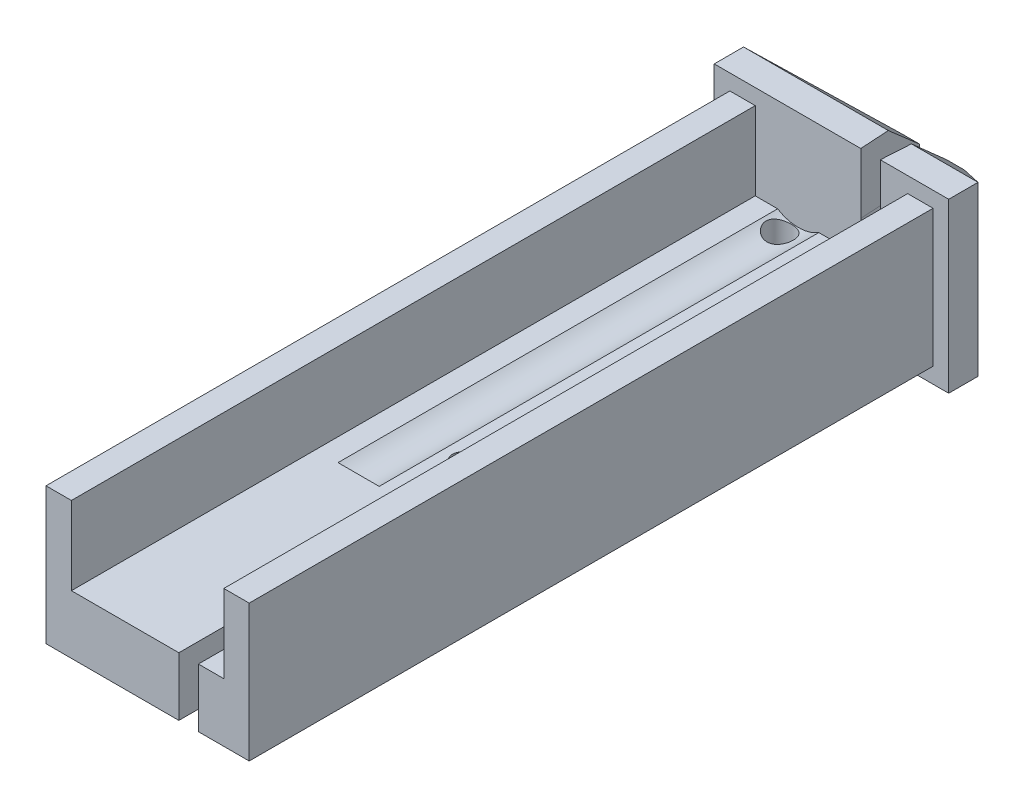
ISO-10303-21;
HEADER;
FILE_DESCRIPTION(('STEP AP214'),'2;1');
FILE_NAME('part.step','',(''),(''),'','','');
FILE_SCHEMA(('AUTOMOTIVE_DESIGN { 1 0 10303 214 1 1 1 1 }'));
ENDSEC;
DATA;
#1=APPLICATION_CONTEXT('core data for automotive mechanical design processes');
#2=APPLICATION_PROTOCOL_DEFINITION('international standard','automotive_design',2000,#1);
#3=PRODUCT_CONTEXT('',#1,'mechanical');
#4=PRODUCT('Part','Part','',(#3));
#5=PRODUCT_RELATED_PRODUCT_CATEGORY('part','',(#4));
#6=PRODUCT_DEFINITION_FORMATION('','',#4);
#7=PRODUCT_DEFINITION_CONTEXT('part definition',#1,'design');
#8=PRODUCT_DEFINITION('design','',#6,#7);
#9=PRODUCT_DEFINITION_SHAPE('','',#8);
#10=(LENGTH_UNIT() NAMED_UNIT(*) SI_UNIT(.MILLI.,.METRE.));
#11=(NAMED_UNIT(*) PLANE_ANGLE_UNIT() SI_UNIT($,.RADIAN.));
#12=(NAMED_UNIT(*) SI_UNIT($,.STERADIAN.) SOLID_ANGLE_UNIT());
#13=UNCERTAINTY_MEASURE_WITH_UNIT(LENGTH_MEASURE(1.E-05),#10,'distance_accuracy_value','');
#14=(GEOMETRIC_REPRESENTATION_CONTEXT(3) GLOBAL_UNCERTAINTY_ASSIGNED_CONTEXT((#13)) GLOBAL_UNIT_ASSIGNED_CONTEXT((#10,
#11,#12)) REPRESENTATION_CONTEXT('',''));
#15=CARTESIAN_POINT('',(0.,0.,0.));
#16=DIRECTION('',(0.,0.,1.));
#17=DIRECTION('',(1.,0.,0.));
#18=AXIS2_PLACEMENT_3D('',#15,#16,#17);
#19=CARTESIAN_POINT('',(-2.05,2.25,19.5904537629872));
#20=DIRECTION('',(0.,1.,0.));
#21=DIRECTION('',(0.,0.,1.));
#22=AXIS2_PLACEMENT_3D('',#19,#20,#21);
#23=PLANE('',#22);
#24=CARTESIAN_POINT('',(-3.85,2.25,11.2));
#25=DIRECTION('',(0.,1.,0.));
#26=DIRECTION('',(0.,0.,1.));
#27=AXIS2_PLACEMENT_3D('',#24,#25,#26);
#28=CIRCLE('',#27,0.250000000000001);
#29=CARTESIAN_POINT('',(-3.85,2.25,11.45));
#30=VERTEX_POINT('',#29);
#31=EDGE_CURVE('E346',#30,#30,#28,.T.);
#32=ORIENTED_EDGE('',*,*,#31,.F.);
#33=EDGE_LOOP('',(#32));
#34=FACE_BOUND('',#33,.T.);
#35=DIRECTION('',(-1.,0.,0.));
#36=VECTOR('',#35,1.);
#37=CARTESIAN_POINT('',(-2.05,2.25,1.6));
#38=LINE('',#37,#36);
#39=CARTESIAN_POINT('',(-2.05,2.25,1.6));
#40=VERTEX_POINT('',#39);
#41=CARTESIAN_POINT('',(-4.32321731235736,2.25,1.6));
#42=VERTEX_POINT('',#41);
#43=EDGE_CURVE('E226',#40,#42,#38,.T.);
#44=ORIENTED_EDGE('',*,*,#43,.T.);
#45=DIRECTION('',(0.,0.,-1.));
#46=VECTOR('',#45,1.);
#47=CARTESIAN_POINT('',(-4.32321731235736,2.25,12.85));
#48=LINE('',#47,#46);
#49=CARTESIAN_POINT('',(-4.32321731235736,2.25,12.85));
#50=VERTEX_POINT('',#49);
#51=EDGE_CURVE('E219',#42,#50,#48,.F.);
#52=ORIENTED_EDGE('',*,*,#51,.T.);
#53=DIRECTION('',(1.,0.,0.));
#54=VECTOR('',#53,1.);
#55=CARTESIAN_POINT('',(-2.05,2.25,12.85));
#56=LINE('',#55,#54);
#57=CARTESIAN_POINT('',(-5.37678268764263,2.25,12.85));
#58=VERTEX_POINT('',#57);
#59=EDGE_CURVE('E11',#58,#50,#56,.T.);
#60=ORIENTED_EDGE('',*,*,#59,.F.);
#61=DIRECTION('',(0.,0.,-1.));
#62=VECTOR('',#61,1.);
#63=CARTESIAN_POINT('',(-5.37678268764263,2.25,12.85));
#64=LINE('',#63,#62);
#65=CARTESIAN_POINT('',(-5.37678268764263,2.25,1.6));
#66=VERTEX_POINT('',#65);
#67=EDGE_CURVE('E211',#58,#66,#64,.T.);
#68=ORIENTED_EDGE('',*,*,#67,.T.);
#69=CARTESIAN_POINT('',(-5.95,2.25,1.6));
#70=VERTEX_POINT('',#69);
#71=EDGE_CURVE('E355',#66,#70,#38,.T.);
#72=ORIENTED_EDGE('',*,*,#71,.T.);
#73=DIRECTION('',(0.,0.,1.));
#74=VECTOR('',#73,1.);
#75=CARTESIAN_POINT('',(-5.95,2.25,19.5904537629872));
#76=LINE('',#75,#74);
#77=CARTESIAN_POINT('',(-5.95,2.25,19.1));
#78=VERTEX_POINT('',#77);
#79=EDGE_CURVE('E357',#70,#78,#76,.T.);
#80=ORIENTED_EDGE('',*,*,#79,.T.);
#81=DIRECTION('',(-1.,0.,0.));
#82=VECTOR('',#81,1.);
#83=CARTESIAN_POINT('',(0.,2.25,19.1));
#84=LINE('',#83,#82);
#85=CARTESIAN_POINT('',(-3.19999965507425,2.25,19.1));
#86=VERTEX_POINT('',#85);
#87=EDGE_CURVE('E408',#86,#78,#84,.T.);
#88=ORIENTED_EDGE('',*,*,#87,.F.);
#89=CARTESIAN_POINT('',(-2.95,2.25,19.0995847136466));
#90=DIRECTION('',(0.,1.,0.));
#91=DIRECTION('',(0.,0.,-1.));
#92=AXIS2_PLACEMENT_3D('',#89,#90,#91);
#93=CIRCLE('',#92,0.25);
#94=CARTESIAN_POINT('',(-3.2,2.25,19.0995847136466));
#95=VERTEX_POINT('',#94);
#96=EDGE_CURVE('E310',#95,#86,#93,.T.);
#97=ORIENTED_EDGE('',*,*,#96,.F.);
#98=DIRECTION('',(0.,0.,1.));
#99=VECTOR('',#98,1.);
#100=CARTESIAN_POINT('',(-3.2,2.25,19.0995847136466));
#101=LINE('',#100,#99);
#102=CARTESIAN_POINT('',(-3.2,2.25,11.0995847136466));
#103=VERTEX_POINT('',#102);
#104=EDGE_CURVE('E318',#103,#95,#101,.T.);
#105=ORIENTED_EDGE('',*,*,#104,.F.);
#106=CARTESIAN_POINT('',(-2.95,2.25,11.0995847136466));
#107=DIRECTION('',(0.,1.,0.));
#108=DIRECTION('',(0.,0.,-1.));
#109=AXIS2_PLACEMENT_3D('',#106,#107,#108);
#110=CIRCLE('',#109,0.25);
#111=CARTESIAN_POINT('',(-2.7,2.25,11.0995847136466));
#112=VERTEX_POINT('',#111);
#113=EDGE_CURVE('E315',#112,#103,#110,.T.);
#114=ORIENTED_EDGE('',*,*,#113,.F.);
#115=DIRECTION('',(0.,0.,-1.));
#116=VECTOR('',#115,1.);
#117=CARTESIAN_POINT('',(-2.7,2.25,19.0995847136466));
#118=LINE('',#117,#116);
#119=CARTESIAN_POINT('',(-2.7,2.25,19.0995847136466));
#120=VERTEX_POINT('',#119);
#121=EDGE_CURVE('E312',#120,#112,#118,.T.);
#122=ORIENTED_EDGE('',*,*,#121,.F.);
#123=CARTESIAN_POINT('',(-2.95,2.25,19.0995847136466));
#124=DIRECTION('',(0.,1.,0.));
#125=DIRECTION('',(0.,0.,1.));
#126=AXIS2_PLACEMENT_3D('',#123,#124,#125);
#127=CIRCLE('',#126,0.25);
#128=CARTESIAN_POINT('',(-2.70000034492575,2.25,19.1));
#129=VERTEX_POINT('',#128);
#130=EDGE_CURVE('E412',#129,#120,#127,.T.);
#131=ORIENTED_EDGE('',*,*,#130,.F.);
#132=CARTESIAN_POINT('',(-2.05,2.25,19.1));
#133=VERTEX_POINT('',#132);
#134=EDGE_CURVE('E409',#133,#129,#84,.T.);
#135=ORIENTED_EDGE('',*,*,#134,.F.);
#136=DIRECTION('',(0.,0.,-1.));
#137=VECTOR('',#136,1.);
#138=CARTESIAN_POINT('',(-2.05,2.25,19.5904537629872));
#139=LINE('',#138,#137);
#140=EDGE_CURVE('E353',#133,#40,#139,.T.);
#141=ORIENTED_EDGE('',*,*,#140,.T.);
#142=EDGE_LOOP('',(#44,#52,#60,#68,#72,#80,#88,#97,#105,#114,#122,#131,#135,#141));
#143=FACE_BOUND('',#142,.T.);
#144=ADVANCED_FACE('F30',(#34,#143),#23,.T.);
#145=CARTESIAN_POINT('',(-4.95,0.25,1.975));
#146=DIRECTION('',(0.,1.,0.));
#147=DIRECTION('',(0.,0.,1.));
#148=AXIS2_PLACEMENT_3D('',#145,#146,#147);
#149=CYLINDRICAL_SURFACE('',#148,0.350000000000001);
#150=CARTESIAN_POINT('',(-4.95,0.75,1.975));
#151=DIRECTION('',(0.,1.,0.));
#152=DIRECTION('',(0.,0.,1.));
#153=AXIS2_PLACEMENT_3D('',#150,#151,#152);
#154=CIRCLE('',#153,0.350000000000001);
#155=CARTESIAN_POINT('',(-4.95,0.75,2.325));
#156=VERTEX_POINT('',#155);
#157=EDGE_CURVE('E305',#156,#156,#154,.T.);
#158=ORIENTED_EDGE('',*,*,#157,.F.);
#159=EDGE_LOOP('',(#158));
#160=FACE_BOUND('',#159,.T.);
#161=CARTESIAN_POINT('',(-4.95,2.10501256289338,2.325));
#162=CARTESIAN_POINT('',(-4.96948627620989,2.10697111255325,2.3249999411586));
#163=CARTESIAN_POINT('',(-4.98891470555133,2.10950741509407,2.32336708853273));
#164=CARTESIAN_POINT('',(-5.02707719232706,2.11561306431647,2.31695593721272));
#165=CARTESIAN_POINT('',(-5.04581101849945,2.11918275163139,2.31217660068403));
#166=CARTESIAN_POINT('',(-5.08203725594585,2.1271166943338,2.29970342292054));
#167=CARTESIAN_POINT('',(-5.09953286488916,2.13147879090894,2.29201744036636));
#168=CARTESIAN_POINT('',(-5.13294607959213,2.14070737631386,2.27398398137059));
#169=CARTESIAN_POINT('',(-5.14886335281744,2.14557397099477,2.26363594571352));
#170=CARTESIAN_POINT('',(-5.17952506758435,2.15570841079544,2.23997421796186));
#171=CARTESIAN_POINT('',(-5.19417423708782,2.16098424385816,2.22654035055146));
#172=CARTESIAN_POINT('',(-5.22104079554144,2.17127180754255,2.19733038100702));
#173=CARTESIAN_POINT('',(-5.2332573684837,2.1762834491288,2.18155349600203));
#174=CARTESIAN_POINT('',(-5.25513267506208,2.18566290388201,2.14765266171371));
#175=CARTESIAN_POINT('',(-5.264734911206,2.19001570994701,2.12948782663586));
#176=CARTESIAN_POINT('',(-5.28066880042925,2.19744668659276,2.09153625053967));
#177=CARTESIAN_POINT('',(-5.28700319827967,2.20052592645357,2.07175088690078));
#178=CARTESIAN_POINT('',(-5.29572380027198,2.20481723311988,2.03280191958871));
#179=CARTESIAN_POINT('',(-5.29838405997621,2.20615837657825,2.01371411406372));
#180=CARTESIAN_POINT('',(-5.30052678340156,2.20723610027683,1.9753196337834));
#181=CARTESIAN_POINT('',(-5.30001083720307,2.2069734833962,1.95601307337311));
#182=CARTESIAN_POINT('',(-5.29600123568894,2.20496541454838,1.91935826419049));
#183=CARTESIAN_POINT('',(-5.29274739156095,2.20333941928339,1.9019762874852));
#184=CARTESIAN_POINT('',(-5.28371709516514,2.19893701910458,1.8680353844219));
#185=CARTESIAN_POINT('',(-5.27794015045645,2.19616038962356,1.85147661943557));
#186=CARTESIAN_POINT('',(-5.26383142614619,2.18961232099479,1.81900664373718));
#187=CARTESIAN_POINT('',(-5.25541922339509,2.18581017978855,1.80313678640347));
#188=CARTESIAN_POINT('',(-5.2363634754599,2.17759510234998,1.77297387491029));
#189=CARTESIAN_POINT('',(-5.22571900759791,2.17318191380621,1.75868147651319));
#190=CARTESIAN_POINT('',(-5.20129631087472,2.16363528138866,1.73060400884988));
#191=CARTESIAN_POINT('',(-5.1873130371332,2.1584736598085,1.71700644687158));
#192=CARTESIAN_POINT('',(-5.15726316180772,2.14824307460437,1.69229770197515));
#193=CARTESIAN_POINT('',(-5.14119582054852,2.14317414461071,1.68118740566967));
#194=CARTESIAN_POINT('',(-5.10658416424887,2.13330366151299,1.66131791866837));
#195=CARTESIAN_POINT('',(-5.08796247784325,2.12852334834691,1.65268210582589));
#196=CARTESIAN_POINT('',(-5.04931005551662,2.11986379758597,1.63875753606944));
#197=CARTESIAN_POINT('',(-5.02927986211157,2.11598421550574,1.63346749822198));
#198=CARTESIAN_POINT('',(-4.98938847676084,2.10956612294286,1.62666381004755));
#199=CARTESIAN_POINT('',(-4.9695650777213,2.10697231495251,1.62498153801248));
#200=CARTESIAN_POINT('',(-4.92980256811626,2.10298935823967,1.62501874739007));
#201=CARTESIAN_POINT('',(-4.9098635047572,2.10159974868726,1.62673692667012));
#202=CARTESIAN_POINT('',(-4.87168573906095,2.10006319873456,1.63335673287453));
#203=CARTESIAN_POINT('',(-4.8534159572269,2.0998480549206,1.63806542403528));
#204=CARTESIAN_POINT('',(-4.81788241379403,2.1003579015384,1.65034893154502));
#205=CARTESIAN_POINT('',(-4.80061866322176,2.10108290227255,1.65792377930157));
#206=CARTESIAN_POINT('',(-4.7675514092057,2.10326660948729,1.67572494120277));
#207=CARTESIAN_POINT('',(-4.75174929883373,2.10472600755455,1.68595375019331));
#208=CARTESIAN_POINT('',(-4.72201441307397,2.10811090347455,1.7087781823042));
#209=CARTESIAN_POINT('',(-4.70808205890509,2.11003650608086,1.72137433721149));
#210=CARTESIAN_POINT('',(-4.68190182575824,2.11413700770716,1.74916333709081));
#211=CARTESIAN_POINT('',(-4.66974405358717,2.11631881239896,1.76444014285165));
#212=CARTESIAN_POINT('',(-4.64812337538251,2.1205269149297,1.79681615011855));
#213=CARTESIAN_POINT('',(-4.63866074085932,2.12255319708616,1.81391553499443));
#214=CARTESIAN_POINT('',(-4.62257305937548,2.12616920857982,1.84976676292892));
#215=CARTESIAN_POINT('',(-4.61599370573988,2.12775177426198,1.8685399085897));
#216=CARTESIAN_POINT('',(-4.60610214976805,2.13018550016675,1.90697235266558));
#217=CARTESIAN_POINT('',(-4.60278917969651,2.13103683225345,1.92663144171082));
#218=CARTESIAN_POINT('',(-4.59958854492415,2.13185912476208,1.96571931278711));
#219=CARTESIAN_POINT('',(-4.59961247346893,2.13185280759702,1.98514040167299));
#220=CARTESIAN_POINT('',(-4.60286433344752,2.1310176989895,2.0236932206228));
#221=CARTESIAN_POINT('',(-4.60609214439847,2.13018893847525,2.04282496154027));
#222=CARTESIAN_POINT('',(-4.61558225252021,2.12785209437582,2.0800172524883));
#223=CARTESIAN_POINT('',(-4.62180611514682,2.12635263162533,2.09808820290313));
#224=CARTESIAN_POINT('',(-4.63708491633356,2.12289805642966,2.1329443406452));
#225=CARTESIAN_POINT('',(-4.64614036065348,2.12094286260048,2.14972929760884));
#226=CARTESIAN_POINT('',(-4.66711413905271,2.11680639454842,2.18201665071719));
#227=CARTESIAN_POINT('',(-4.67910178029686,2.11462051252981,2.19747345410404));
#228=CARTESIAN_POINT('',(-4.70549479968853,2.11040589712198,2.22619237181769));
#229=CARTESIAN_POINT('',(-4.71990048801002,2.10837718394238,2.23945420415151));
#230=CARTESIAN_POINT('',(-4.75096961692745,2.10479128727534,2.2635806944175));
#231=CARTESIAN_POINT('',(-4.76766085037085,2.10324082189436,2.27441066397161));
#232=CARTESIAN_POINT('',(-4.80267881622469,2.10096655391752,2.29310376081872));
#233=CARTESIAN_POINT('',(-4.82100491107955,2.10024243057494,2.30096803845824));
#234=CARTESIAN_POINT('',(-4.85762041602023,2.0998714816256,2.3131062198779));
#235=CARTESIAN_POINT('',(-4.87584812208067,2.1001635810084,2.31756467442213));
#236=CARTESIAN_POINT('',(-4.91273482218285,2.10179911652902,2.32351147167158));
#237=CARTESIAN_POINT('',(-4.9313937809868,2.10314246706146,2.32500005618395));
#238=CARTESIAN_POINT('',(-4.95,2.10501256289338,2.325));
#239=B_SPLINE_CURVE_WITH_KNOTS('',3,(#161,#162,#163,#164,#165,#166,#167,#168,#169,#170,#171,
#172,#173,#174,#175,#176,#177,#178,#179,#180,#181,#182,#183,#184,#185,#186,#187,#188,#189,#190,
#191,#192,#193,#194,#195,#196,#197,#198,#199,#200,#201,#202,#203,#204,#205,#206,#207,#208,#209,
#210,#211,#212,#213,#214,#215,#216,#217,#218,#219,#220,#221,#222,#223,#224,#225,#226,#227,#228,
#229,#230,#231,#232,#233,#234,#235,#236,#237,#238),.UNSPECIFIED.,.T.,.F.,(4,2,2,2,2,2,2,2,2,2,2,
2,2,2,2,2,2,2,2,2,2,2,2,2,2,2,2,2,2,2,2,2,2,2,2,2,2,2,4),(0.,0.0586816038631861,
0.11738257293864,0.175925954266463,0.234481643815182,0.295897681413664,0.357334286276331,
0.42000877480975,0.482630534797345,0.540269411059443,0.597879434346013,0.65091280466086,
0.703956530281538,0.758809556783269,0.813685300919544,0.873947566788973,0.934231279709454,
0.997138811288943,1.06002224405146,1.11989605545045,1.17974694384599,1.23608198483342,
1.29241764316212,1.34880645269809,1.40520794426403,1.46387427480348,1.52254651334885,
1.58211762148018,1.64167472459536,1.6996542481474,1.75763159144643,1.81488423431394,
1.87214710914484,1.93092264016827,1.98970571636798,2.04928043414239,2.10883201996851,
2.1648679536991,2.22089932479142),.UNSPECIFIED.);
#240=CARTESIAN_POINT('',(-4.95,2.10501256289338,2.325));
#241=VERTEX_POINT('',#240);
#242=EDGE_CURVE('E220',#241,#241,#239,.T.);
#243=ORIENTED_EDGE('',*,*,#242,.F.);
#244=EDGE_LOOP('',(#243));
#245=FACE_BOUND('',#244,.T.);
#246=ADVANCED_FACE('F426',(#160,#245),#149,.F.);
#247=CARTESIAN_POINT('',(0.,5.,0.));
#248=DIRECTION('',(0.,0.,1.));
#249=DIRECTION('',(1.,0.,0.));
#250=AXIS2_PLACEMENT_3D('',#247,#248,#249);
#251=PLANE('',#250);
#252=DIRECTION('',(0.,1.,0.));
#253=VECTOR('',#252,1.);
#254=CARTESIAN_POINT('',(-2.2,0.35,0.));
#255=LINE('',#254,#253);
#256=CARTESIAN_POINT('',(-2.2,2.3,0.));
#257=VERTEX_POINT('',#256);
#258=CARTESIAN_POINT('',(-2.2,3.9,0.));
#259=VERTEX_POINT('',#258);
#260=EDGE_CURVE('E258',#257,#259,#255,.T.);
#261=ORIENTED_EDGE('',*,*,#260,.F.);
#262=DIRECTION('',(-1.,0.,0.));
#263=VECTOR('',#262,1.);
#264=CARTESIAN_POINT('',(-0.999999999999997,2.3,0.));
#265=LINE('',#264,#263);
#266=CARTESIAN_POINT('',(-3.8,2.3,0.));
#267=VERTEX_POINT('',#266);
#268=EDGE_CURVE('E229',#257,#267,#265,.T.);
#269=ORIENTED_EDGE('',*,*,#268,.T.);
#270=DIRECTION('',(0.,1.,0.));
#271=VECTOR('',#270,1.);
#272=CARTESIAN_POINT('',(-3.8,0.35,0.));
#273=LINE('',#272,#271);
#274=CARTESIAN_POINT('',(-3.8,3.9,0.));
#275=VERTEX_POINT('',#274);
#276=EDGE_CURVE('E53',#267,#275,#273,.T.);
#277=ORIENTED_EDGE('',*,*,#276,.T.);
#278=DIRECTION('',(-1.,0.,0.));
#279=VECTOR('',#278,1.);
#280=CARTESIAN_POINT('',(-0.999999999999997,3.9,0.));
#281=LINE('',#280,#279);
#282=CARTESIAN_POINT('',(-3.34786019224077,3.9,0.));
#283=VERTEX_POINT('',#282);
#284=EDGE_CURVE('E237',#283,#275,#281,.T.);
#285=ORIENTED_EDGE('',*,*,#284,.F.);
#286=DIRECTION('',(0.,-1.,0.));
#287=VECTOR('',#286,1.);
#288=CARTESIAN_POINT('',(-3.34786019224077,3.1,0.));
#289=LINE('',#288,#287);
#290=CARTESIAN_POINT('',(-3.34786019224077,3.1,0.));
#291=VERTEX_POINT('',#290);
#292=EDGE_CURVE('E297',#283,#291,#289,.T.);
#293=ORIENTED_EDGE('',*,*,#292,.T.);
#294=CARTESIAN_POINT('',(-3.,3.1,0.));
#295=DIRECTION('',(0.,0.,1.));
#296=DIRECTION('',(1.,0.,0.));
#297=AXIS2_PLACEMENT_3D('',#294,#295,#296);
#298=CIRCLE('',#297,0.347860192240775);
#299=CARTESIAN_POINT('',(-2.65213980775922,3.1,0.));
#300=VERTEX_POINT('',#299);
#301=EDGE_CURVE('E293',#291,#300,#298,.T.);
#302=ORIENTED_EDGE('',*,*,#301,.T.);
#303=DIRECTION('',(0.,1.,0.));
#304=VECTOR('',#303,1.);
#305=CARTESIAN_POINT('',(-2.65213980775922,3.1,0.));
#306=LINE('',#305,#304);
#307=CARTESIAN_POINT('',(-2.65213980775922,3.9,0.));
#308=VERTEX_POINT('',#307);
#309=EDGE_CURVE('E296',#300,#308,#306,.T.);
#310=ORIENTED_EDGE('',*,*,#309,.T.);
#311=EDGE_CURVE('E244',#259,#308,#281,.T.);
#312=ORIENTED_EDGE('',*,*,#311,.F.);
#313=EDGE_LOOP('',(#261,#269,#277,#285,#293,#302,#310,#312));
#314=FACE_BOUND('',#313,.T.);
#315=ADVANCED_FACE('F32',(#314),#251,.F.);
#316=CARTESIAN_POINT('',(-18.6,0.75,1.6));
#317=DIRECTION('',(0.,0.,-1.));
#318=DIRECTION('',(0.,1.,0.));
#319=AXIS2_PLACEMENT_3D('',#316,#317,#318);
#320=PLANE('',#319);
#321=CARTESIAN_POINT('',(-4.85,3.1,1.6));
#322=DIRECTION('',(0.,0.,1.));
#323=DIRECTION('',(1.,0.,0.));
#324=AXIS2_PLACEMENT_3D('',#321,#322,#323);
#325=CIRCLE('',#324,1.);
#326=EDGE_CURVE('E45',#66,#42,#325,.T.);
#327=ORIENTED_EDGE('',*,*,#326,.T.);
#328=ORIENTED_EDGE('',*,*,#43,.F.);
#329=DIRECTION('',(0.,1.,0.));
#330=VECTOR('',#329,1.);
#331=CARTESIAN_POINT('',(-2.05,2.25,1.6));
#332=LINE('',#331,#330);
#333=CARTESIAN_POINT('',(-2.05,4.25,1.6));
#334=VERTEX_POINT('',#333);
#335=EDGE_CURVE('E360',#40,#334,#332,.T.);
#336=ORIENTED_EDGE('',*,*,#335,.T.);
#337=DIRECTION('',(1.,0.,0.));
#338=VECTOR('',#337,1.);
#339=CARTESIAN_POINT('',(-18.6,4.25,1.6));
#340=LINE('',#339,#338);
#341=CARTESIAN_POINT('',(-1.4,4.25,1.6));
#342=VERTEX_POINT('',#341);
#343=EDGE_CURVE('E384',#334,#342,#340,.T.);
#344=ORIENTED_EDGE('',*,*,#343,.T.);
#345=DIRECTION('',(0.,-1.,0.));
#346=VECTOR('',#345,1.);
#347=CARTESIAN_POINT('',(-1.4,19.35,1.6));
#348=LINE('',#347,#346);
#349=CARTESIAN_POINT('',(-1.4,0.75,1.6));
#350=VERTEX_POINT('',#349);
#351=EDGE_CURVE('E372',#342,#350,#348,.T.);
#352=ORIENTED_EDGE('',*,*,#351,.T.);
#353=DIRECTION('',(1.,0.,0.));
#354=VECTOR('',#353,1.);
#355=CARTESIAN_POINT('',(-18.6,0.75,1.6));
#356=LINE('',#355,#354);
#357=CARTESIAN_POINT('',(-6.6,0.75,1.6));
#358=VERTEX_POINT('',#357);
#359=EDGE_CURVE('E388',#358,#350,#356,.T.);
#360=ORIENTED_EDGE('',*,*,#359,.F.);
#361=DIRECTION('',(0.,-1.,0.));
#362=VECTOR('',#361,1.);
#363=CARTESIAN_POINT('',(-6.6,19.35,1.6));
#364=LINE('',#363,#362);
#365=CARTESIAN_POINT('',(-6.6,4.25,1.6));
#366=VERTEX_POINT('',#365);
#367=EDGE_CURVE('E380',#366,#358,#364,.T.);
#368=ORIENTED_EDGE('',*,*,#367,.F.);
#369=CARTESIAN_POINT('',(-5.95,4.25,1.6));
#370=VERTEX_POINT('',#369);
#371=EDGE_CURVE('E385',#366,#370,#340,.T.);
#372=ORIENTED_EDGE('',*,*,#371,.T.);
#373=DIRECTION('',(0.,1.,0.));
#374=VECTOR('',#373,1.);
#375=CARTESIAN_POINT('',(-5.95,2.25,1.6));
#376=LINE('',#375,#374);
#377=EDGE_CURVE('E362',#70,#370,#376,.T.);
#378=ORIENTED_EDGE('',*,*,#377,.F.);
#379=ORIENTED_EDGE('',*,*,#71,.F.);
#380=EDGE_LOOP('',(#327,#328,#336,#344,#352,#360,#368,#372,#378,#379));
#381=FACE_BOUND('',#380,.T.);
#382=DIRECTION('',(-1.,0.,0.));
#383=VECTOR('',#382,1.);
#384=CARTESIAN_POINT('',(-7.,4.65,1.6));
#385=LINE('',#384,#383);
#386=CARTESIAN_POINT('',(-3.25,4.65,1.6));
#387=VERTEX_POINT('',#386);
#388=CARTESIAN_POINT('',(-7.,4.65,1.6));
#389=VERTEX_POINT('',#388);
#390=EDGE_CURVE('E271',#387,#389,#385,.T.);
#391=ORIENTED_EDGE('',*,*,#390,.T.);
#392=DIRECTION('',(0.,-1.,0.));
#393=VECTOR('',#392,1.);
#394=CARTESIAN_POINT('',(-7.,4.65,1.6));
#395=LINE('',#394,#393);
#396=CARTESIAN_POINT('',(-7.,0.35,1.6));
#397=VERTEX_POINT('',#396);
#398=EDGE_CURVE('E260',#389,#397,#395,.T.);
#399=ORIENTED_EDGE('',*,*,#398,.T.);
#400=DIRECTION('',(1.,0.,0.));
#401=VECTOR('',#400,1.);
#402=CARTESIAN_POINT('',(-7.,0.35,1.6));
#403=LINE('',#402,#401);
#404=CARTESIAN_POINT('',(-0.999999999999997,0.35,1.6));
#405=VERTEX_POINT('',#404);
#406=EDGE_CURVE('E265',#397,#405,#403,.T.);
#407=ORIENTED_EDGE('',*,*,#406,.T.);
#408=DIRECTION('',(0.,1.,0.));
#409=VECTOR('',#408,1.);
#410=CARTESIAN_POINT('',(-0.999999999999998,4.65,1.6));
#411=LINE('',#410,#409);
#412=CARTESIAN_POINT('',(-0.999999999999998,4.65,1.6));
#413=VERTEX_POINT('',#412);
#414=EDGE_CURVE('E268',#405,#413,#411,.T.);
#415=ORIENTED_EDGE('',*,*,#414,.T.);
#416=CARTESIAN_POINT('',(-2.75,4.65,1.6));
#417=VERTEX_POINT('',#416);
#418=EDGE_CURVE('E272',#413,#417,#385,.T.);
#419=ORIENTED_EDGE('',*,*,#418,.T.);
#420=DIRECTION('',(0.,1.,0.));
#421=VECTOR('',#420,1.);
#422=CARTESIAN_POINT('',(-2.75,3.1,1.6));
#423=LINE('',#422,#421);
#424=CARTESIAN_POINT('',(-2.75,3.1,1.6));
#425=VERTEX_POINT('',#424);
#426=EDGE_CURVE('E288',#425,#417,#423,.T.);
#427=ORIENTED_EDGE('',*,*,#426,.F.);
#428=CARTESIAN_POINT('',(-3.,3.1,1.6));
#429=DIRECTION('',(0.,0.,1.));
#430=DIRECTION('',(1.,0.,0.));
#431=AXIS2_PLACEMENT_3D('',#428,#429,#430);
#432=CIRCLE('',#431,0.25);
#433=CARTESIAN_POINT('',(-3.25,3.1,1.6));
#434=VERTEX_POINT('',#433);
#435=EDGE_CURVE('E286',#434,#425,#432,.T.);
#436=ORIENTED_EDGE('',*,*,#435,.F.);
#437=DIRECTION('',(0.,-1.,0.));
#438=VECTOR('',#437,1.);
#439=CARTESIAN_POINT('',(-3.25,3.1,1.6));
#440=LINE('',#439,#438);
#441=EDGE_CURVE('E291',#387,#434,#440,.T.);
#442=ORIENTED_EDGE('',*,*,#441,.F.);
#443=EDGE_LOOP('',(#391,#399,#407,#415,#419,#427,#436,#442));
#444=FACE_BOUND('',#443,.T.);
#445=ADVANCED_FACE('F479',(#381,#444),#320,.F.);
#446=CARTESIAN_POINT('',(-3.25,3.1,1.6));
#447=DIRECTION('',(-0.998134798421867,0.,0.061048539534857));
#448=DIRECTION('',(0.061048539534857,0.,0.998134798421867));
#449=AXIS2_PLACEMENT_3D('',#446,#447,#448);
#450=PLANE('',#449);
#451=ORIENTED_EDGE('',*,*,#292,.F.);
#452=DIRECTION('',(0.0458138924220209,0.660926929321428,0.749050519897618));
#453=VECTOR('',#452,1.);
#454=CARTESIAN_POINT('',(-3.31697142852805,4.34561190223973,0.505026822538356));
#455=LINE('',#454,#453);
#456=CARTESIAN_POINT('',(-3.29587196511286,4.65,0.850000000000001));
#457=VERTEX_POINT('',#456);
#458=EDGE_CURVE('E250',#283,#457,#455,.T.);
#459=ORIENTED_EDGE('',*,*,#458,.T.);
#460=DIRECTION('',(-0.061048539534857,0.,-0.998134798421867));
#461=VECTOR('',#460,1.);
#462=CARTESIAN_POINT('',(-3.25,4.65,1.6));
#463=LINE('',#462,#461);
#464=EDGE_CURVE('E278',#387,#457,#463,.T.);
#465=ORIENTED_EDGE('',*,*,#464,.F.);
#466=ORIENTED_EDGE('',*,*,#441,.T.);
#467=DIRECTION('',(-0.061048539534857,0.,-0.998134798421867));
#468=VECTOR('',#467,1.);
#469=CARTESIAN_POINT('',(-3.25,3.1,1.6));
#470=LINE('',#469,#468);
#471=EDGE_CURVE('E302',#291,#434,#470,.F.);
#472=ORIENTED_EDGE('',*,*,#471,.F.);
#473=EDGE_LOOP('',(#451,#459,#465,#466,#472));
#474=FACE_BOUND('',#473,.T.);
#475=ADVANCED_FACE('F476',(#474),#450,.F.);
#476=CARTESIAN_POINT('',(-2.75,3.1,1.6));
#477=DIRECTION('',(0.998134798421867,0.,0.061048539534857));
#478=DIRECTION('',(0.061048539534857,0.,-0.998134798421867));
#479=AXIS2_PLACEMENT_3D('',#476,#477,#478);
#480=PLANE('',#479);
#481=DIRECTION('',(-0.061048539534857,0.,0.998134798421867));
#482=VECTOR('',#481,1.);
#483=CARTESIAN_POINT('',(-2.75,4.65,1.6));
#484=LINE('',#483,#482);
#485=CARTESIAN_POINT('',(-2.70412803488713,4.65,0.850000000000001));
#486=VERTEX_POINT('',#485);
#487=EDGE_CURVE('E415',#486,#417,#484,.T.);
#488=ORIENTED_EDGE('',*,*,#487,.F.);
#489=DIRECTION('',(0.0458138924220209,-0.660926929321428,-0.749050519897618));
#490=VECTOR('',#489,1.);
#491=CARTESIAN_POINT('',(-2.68302857147194,4.34561190223973,0.505026822538356));
#492=LINE('',#491,#490);
#493=EDGE_CURVE('E247',#486,#308,#492,.T.);
#494=ORIENTED_EDGE('',*,*,#493,.T.);
#495=ORIENTED_EDGE('',*,*,#309,.F.);
#496=DIRECTION('',(0.061048539534857,0.,-0.998134798421867));
#497=VECTOR('',#496,1.);
#498=CARTESIAN_POINT('',(-2.75,3.1,1.6));
#499=LINE('',#498,#497);
#500=EDGE_CURVE('E299',#300,#425,#499,.F.);
#501=ORIENTED_EDGE('',*,*,#500,.T.);
#502=ORIENTED_EDGE('',*,*,#426,.T.);
#503=EDGE_LOOP('',(#488,#494,#495,#501,#502));
#504=FACE_BOUND('',#503,.T.);
#505=ADVANCED_FACE('F473',(#504),#480,.F.);
#506=CARTESIAN_POINT('',(0.,5.,19.1));
#507=DIRECTION('',(0.,0.,1.));
#508=DIRECTION('',(1.,0.,0.));
#509=AXIS2_PLACEMENT_3D('',#506,#507,#508);
#510=PLANE('',#509);
#511=DIRECTION('',(0.,1.,0.));
#512=VECTOR('',#511,1.);
#513=CARTESIAN_POINT('',(-2.70000034492575,0.25,19.1));
#514=LINE('',#513,#512);
#515=CARTESIAN_POINT('',(-2.70000034492575,0.75,19.1));
#516=VERTEX_POINT('',#515);
#517=EDGE_CURVE('E341',#516,#129,#514,.T.);
#518=ORIENTED_EDGE('',*,*,#517,.F.);
#519=DIRECTION('',(-1.,0.,0.));
#520=VECTOR('',#519,1.);
#521=CARTESIAN_POINT('',(0.,0.75,19.1));
#522=LINE('',#521,#520);
#523=CARTESIAN_POINT('',(-1.4,0.75,19.1));
#524=VERTEX_POINT('',#523);
#525=EDGE_CURVE('E392',#524,#516,#522,.T.);
#526=ORIENTED_EDGE('',*,*,#525,.F.);
#527=DIRECTION('',(0.,-1.,0.));
#528=VECTOR('',#527,1.);
#529=CARTESIAN_POINT('',(-1.4,5.,19.1));
#530=LINE('',#529,#528);
#531=CARTESIAN_POINT('',(-1.4,4.25,19.1));
#532=VERTEX_POINT('',#531);
#533=EDGE_CURVE('E375',#532,#524,#530,.T.);
#534=ORIENTED_EDGE('',*,*,#533,.F.);
#535=DIRECTION('',(1.,0.,0.));
#536=VECTOR('',#535,1.);
#537=CARTESIAN_POINT('',(0.,4.25,19.1));
#538=LINE('',#537,#536);
#539=CARTESIAN_POINT('',(-2.05,4.25,19.1));
#540=VERTEX_POINT('',#539);
#541=EDGE_CURVE('E395',#540,#532,#538,.T.);
#542=ORIENTED_EDGE('',*,*,#541,.F.);
#543=DIRECTION('',(0.,1.,0.));
#544=VECTOR('',#543,1.);
#545=CARTESIAN_POINT('',(-2.05,5.,19.1));
#546=LINE('',#545,#544);
#547=EDGE_CURVE('E368',#133,#540,#546,.T.);
#548=ORIENTED_EDGE('',*,*,#547,.F.);
#549=ORIENTED_EDGE('',*,*,#134,.T.);
#550=EDGE_LOOP('',(#518,#526,#534,#542,#548,#549));
#551=FACE_BOUND('',#550,.T.);
#552=ADVANCED_FACE('F475',(#551),#510,.T.);
#553=CARTESIAN_POINT('',(-18.6,4.25,19.1920209287116));
#554=DIRECTION('',(0.,-1.,0.));
#555=DIRECTION('',(0.,0.,-1.));
#556=AXIS2_PLACEMENT_3D('',#553,#554,#555);
#557=PLANE('',#556);
#558=ORIENTED_EDGE('',*,*,#343,.F.);
#559=DIRECTION('',(0.,0.,1.));
#560=VECTOR('',#559,1.);
#561=CARTESIAN_POINT('',(-2.05,4.25,19.1920209287116));
#562=LINE('',#561,#560);
#563=EDGE_CURVE('E405',#334,#540,#562,.T.);
#564=ORIENTED_EDGE('',*,*,#563,.T.);
#565=ORIENTED_EDGE('',*,*,#541,.T.);
#566=DIRECTION('',(0.,0.,-1.));
#567=VECTOR('',#566,1.);
#568=CARTESIAN_POINT('',(-1.4,4.25,19.1920209287116));
#569=LINE('',#568,#567);
#570=EDGE_CURVE('E402',#532,#342,#569,.T.);
#571=ORIENTED_EDGE('',*,*,#570,.T.);
#572=EDGE_LOOP('',(#558,#564,#565,#571));
#573=FACE_BOUND('',#572,.T.);
#574=ADVANCED_FACE('F519',(#573),#557,.F.);
#575=DIRECTION('',(0.,1.,0.));
#576=VECTOR('',#575,1.);
#577=CARTESIAN_POINT('',(-3.19999965507425,0.25,19.1));
#578=LINE('',#577,#576);
#579=CARTESIAN_POINT('',(-3.19999965507425,0.75,19.1));
#580=VERTEX_POINT('',#579);
#581=EDGE_CURVE('E344',#86,#580,#578,.F.);
#582=ORIENTED_EDGE('',*,*,#581,.F.);
#583=ORIENTED_EDGE('',*,*,#87,.T.);
#584=DIRECTION('',(0.,-1.,0.));
#585=VECTOR('',#584,1.);
#586=CARTESIAN_POINT('',(-5.95,5.,19.1));
#587=LINE('',#586,#585);
#588=CARTESIAN_POINT('',(-5.95,4.25,19.1));
#589=VERTEX_POINT('',#588);
#590=EDGE_CURVE('E364',#589,#78,#587,.T.);
#591=ORIENTED_EDGE('',*,*,#590,.F.);
#592=CARTESIAN_POINT('',(-6.6,4.25,19.1));
#593=VERTEX_POINT('',#592);
#594=EDGE_CURVE('E396',#593,#589,#538,.T.);
#595=ORIENTED_EDGE('',*,*,#594,.F.);
#596=DIRECTION('',(0.,1.,0.));
#597=VECTOR('',#596,1.);
#598=CARTESIAN_POINT('',(-6.6,5.,19.1));
#599=LINE('',#598,#597);
#600=CARTESIAN_POINT('',(-6.6,0.75,19.1));
#601=VERTEX_POINT('',#600);
#602=EDGE_CURVE('E382',#601,#593,#599,.T.);
#603=ORIENTED_EDGE('',*,*,#602,.F.);
#604=EDGE_CURVE('E391',#580,#601,#522,.T.);
#605=ORIENTED_EDGE('',*,*,#604,.F.);
#606=EDGE_LOOP('',(#582,#583,#591,#595,#603,#605));
#607=FACE_BOUND('',#606,.T.);
#608=ADVANCED_FACE('F521',(#607),#510,.T.);
#609=CARTESIAN_POINT('',(-18.6,0.75,19.3069108349684));
#610=DIRECTION('',(0.,1.,0.));
#611=DIRECTION('',(0.,0.,1.));
#612=AXIS2_PLACEMENT_3D('',#609,#610,#611);
#613=PLANE('',#612);
#614=ORIENTED_EDGE('',*,*,#157,.T.);
#615=EDGE_LOOP('',(#614));
#616=FACE_BOUND('',#615,.T.);
#617=CARTESIAN_POINT('',(-3.85,0.75,11.2));
#618=DIRECTION('',(0.,1.,0.));
#619=DIRECTION('',(0.,0.,1.));
#620=AXIS2_PLACEMENT_3D('',#617,#618,#619);
#621=CIRCLE('',#620,0.250000000000001);
#622=CARTESIAN_POINT('',(-3.85,0.75,11.45));
#623=VERTEX_POINT('',#622);
#624=EDGE_CURVE('E349',#623,#623,#621,.T.);
#625=ORIENTED_EDGE('',*,*,#624,.T.);
#626=EDGE_LOOP('',(#625));
#627=FACE_BOUND('',#626,.T.);
#628=DIRECTION('',(0.,0.,1.));
#629=VECTOR('',#628,1.);
#630=CARTESIAN_POINT('',(-3.2,0.75,19.3069108349684));
#631=LINE('',#630,#629);
#632=CARTESIAN_POINT('',(-3.2,0.75,11.0995847136466));
#633=VERTEX_POINT('',#632);
#634=CARTESIAN_POINT('',(-3.2,0.75,19.0995847136466));
#635=VERTEX_POINT('',#634);
#636=EDGE_CURVE('E335',#633,#635,#631,.T.);
#637=ORIENTED_EDGE('',*,*,#636,.T.);
#638=CARTESIAN_POINT('',(-2.95,0.75,19.0995847136466));
#639=DIRECTION('',(0.,1.,0.));
#640=DIRECTION('',(0.,0.,1.));
#641=AXIS2_PLACEMENT_3D('',#638,#639,#640);
#642=CIRCLE('',#641,0.25);
#643=EDGE_CURVE('E342',#635,#580,#642,.T.);
#644=ORIENTED_EDGE('',*,*,#643,.T.);
#645=ORIENTED_EDGE('',*,*,#604,.T.);
#646=DIRECTION('',(0.,0.,1.));
#647=VECTOR('',#646,1.);
#648=CARTESIAN_POINT('',(-6.6,0.75,19.3657074340528));
#649=LINE('',#648,#647);
#650=EDGE_CURVE('E377',#358,#601,#649,.T.);
#651=ORIENTED_EDGE('',*,*,#650,.F.);
#652=ORIENTED_EDGE('',*,*,#359,.T.);
#653=DIRECTION('',(0.,0.,-1.));
#654=VECTOR('',#653,1.);
#655=CARTESIAN_POINT('',(-1.4,0.75,19.3954436450839));
#656=LINE('',#655,#654);
#657=EDGE_CURVE('E370',#524,#350,#656,.T.);
#658=ORIENTED_EDGE('',*,*,#657,.F.);
#659=ORIENTED_EDGE('',*,*,#525,.T.);
#660=CARTESIAN_POINT('',(-2.7,0.75,19.0995847136466));
#661=VERTEX_POINT('',#660);
#662=EDGE_CURVE('E338',#516,#661,#642,.T.);
#663=ORIENTED_EDGE('',*,*,#662,.T.);
#664=DIRECTION('',(0.,0.,-1.));
#665=VECTOR('',#664,1.);
#666=CARTESIAN_POINT('',(-2.7,0.75,19.3069108349684));
#667=LINE('',#666,#665);
#668=CARTESIAN_POINT('',(-2.7,0.75,11.0995847136466));
#669=VERTEX_POINT('',#668);
#670=EDGE_CURVE('E324',#661,#669,#667,.T.);
#671=ORIENTED_EDGE('',*,*,#670,.T.);
#672=CARTESIAN_POINT('',(-2.95,0.75,11.0995847136466));
#673=DIRECTION('',(0.,1.,0.));
#674=DIRECTION('',(0.,0.,1.));
#675=AXIS2_PLACEMENT_3D('',#672,#673,#674);
#676=CIRCLE('',#675,0.25);
#677=EDGE_CURVE('E332',#669,#633,#676,.T.);
#678=ORIENTED_EDGE('',*,*,#677,.T.);
#679=EDGE_LOOP('',(#637,#644,#645,#651,#652,#658,#659,#663,#671,#678));
#680=FACE_BOUND('',#679,.T.);
#681=ADVANCED_FACE('F517',(#616,#627,#680),#613,.F.);
#682=ORIENTED_EDGE('',*,*,#594,.T.);
#683=DIRECTION('',(0.,0.,1.));
#684=VECTOR('',#683,1.);
#685=CARTESIAN_POINT('',(-5.95,4.25,19.5904537629872));
#686=LINE('',#685,#684);
#687=EDGE_CURVE('E352',#370,#589,#686,.T.);
#688=ORIENTED_EDGE('',*,*,#687,.F.);
#689=ORIENTED_EDGE('',*,*,#371,.F.);
#690=DIRECTION('',(0.,0.,1.));
#691=VECTOR('',#690,1.);
#692=CARTESIAN_POINT('',(-6.6,4.25,19.1920209287116));
#693=LINE('',#692,#691);
#694=EDGE_CURVE('E399',#366,#593,#693,.T.);
#695=ORIENTED_EDGE('',*,*,#694,.T.);
#696=EDGE_LOOP('',(#682,#688,#689,#695));
#697=FACE_BOUND('',#696,.T.);
#698=ADVANCED_FACE('F513',(#697),#557,.F.);
#699=CARTESIAN_POINT('',(-6.6,19.35,19.3657074340528));
#700=DIRECTION('',(1.,0.,0.));
#701=DIRECTION('',(0.,0.,-1.));
#702=AXIS2_PLACEMENT_3D('',#699,#700,#701);
#703=PLANE('',#702);
#704=ORIENTED_EDGE('',*,*,#602,.T.);
#705=ORIENTED_EDGE('',*,*,#694,.F.);
#706=ORIENTED_EDGE('',*,*,#367,.T.);
#707=ORIENTED_EDGE('',*,*,#650,.T.);
#708=EDGE_LOOP('',(#704,#705,#706,#707));
#709=FACE_BOUND('',#708,.T.);
#710=ADVANCED_FACE('F509',(#709),#703,.F.);
#711=CARTESIAN_POINT('',(-1.4,19.35,19.3954436450839));
#712=DIRECTION('',(-1.,0.,0.));
#713=DIRECTION('',(0.,0.,1.));
#714=AXIS2_PLACEMENT_3D('',#711,#712,#713);
#715=PLANE('',#714);
#716=ORIENTED_EDGE('',*,*,#533,.T.);
#717=ORIENTED_EDGE('',*,*,#657,.T.);
#718=ORIENTED_EDGE('',*,*,#351,.F.);
#719=ORIENTED_EDGE('',*,*,#570,.F.);
#720=EDGE_LOOP('',(#716,#717,#718,#719));
#721=FACE_BOUND('',#720,.T.);
#722=ADVANCED_FACE('F505',(#721),#715,.F.);
#723=CARTESIAN_POINT('',(-2.05,2.25,19.5904537629872));
#724=DIRECTION('',(1.,0.,0.));
#725=DIRECTION('',(0.,0.,-1.));
#726=AXIS2_PLACEMENT_3D('',#723,#724,#725);
#727=PLANE('',#726);
#728=ORIENTED_EDGE('',*,*,#547,.T.);
#729=ORIENTED_EDGE('',*,*,#563,.F.);
#730=ORIENTED_EDGE('',*,*,#335,.F.);
#731=ORIENTED_EDGE('',*,*,#140,.F.);
#732=EDGE_LOOP('',(#728,#729,#730,#731));
#733=FACE_BOUND('',#732,.T.);
#734=ADVANCED_FACE('F501',(#733),#727,.F.);
#735=CARTESIAN_POINT('',(-5.95,2.25,19.5904537629872));
#736=DIRECTION('',(-1.,0.,0.));
#737=DIRECTION('',(0.,0.,1.));
#738=AXIS2_PLACEMENT_3D('',#735,#736,#737);
#739=PLANE('',#738);
#740=ORIENTED_EDGE('',*,*,#590,.T.);
#741=ORIENTED_EDGE('',*,*,#79,.F.);
#742=ORIENTED_EDGE('',*,*,#377,.T.);
#743=ORIENTED_EDGE('',*,*,#687,.T.);
#744=EDGE_LOOP('',(#740,#741,#742,#743));
#745=FACE_BOUND('',#744,.T.);
#746=ADVANCED_FACE('F498',(#745),#739,.F.);
#747=CARTESIAN_POINT('',(-3.85,0.25,11.2));
#748=DIRECTION('',(0.,1.,0.));
#749=DIRECTION('',(0.,0.,1.));
#750=AXIS2_PLACEMENT_3D('',#747,#748,#749);
#751=CYLINDRICAL_SURFACE('',#750,0.250000000000001);
#752=ORIENTED_EDGE('',*,*,#31,.T.);
#753=EDGE_LOOP('',(#752));
#754=FACE_BOUND('',#753,.T.);
#755=ORIENTED_EDGE('',*,*,#624,.F.);
#756=EDGE_LOOP('',(#755));
#757=FACE_BOUND('',#756,.T.);
#758=ADVANCED_FACE('F496',(#754,#757),#751,.F.);
#759=CARTESIAN_POINT('',(-2.95,0.25,19.0995847136466));
#760=DIRECTION('',(0.,1.,0.));
#761=DIRECTION('',(0.,0.,1.));
#762=AXIS2_PLACEMENT_3D('',#759,#760,#761);
#763=CYLINDRICAL_SURFACE('',#762,0.25);
#764=ORIENTED_EDGE('',*,*,#581,.T.);
#765=ORIENTED_EDGE('',*,*,#643,.F.);
#766=DIRECTION('',(0.,1.,0.));
#767=VECTOR('',#766,1.);
#768=CARTESIAN_POINT('',(-3.2,0.25,19.0995847136466));
#769=LINE('',#768,#767);
#770=EDGE_CURVE('E322',#635,#95,#769,.T.);
#771=ORIENTED_EDGE('',*,*,#770,.T.);
#772=ORIENTED_EDGE('',*,*,#96,.T.);
#773=EDGE_LOOP('',(#764,#765,#771,#772));
#774=FACE_BOUND('',#773,.T.);
#775=ADVANCED_FACE('F568',(#774),#763,.F.);
#776=CARTESIAN_POINT('',(-3.2,0.25,19.0995847136466));
#777=DIRECTION('',(-1.,0.,0.));
#778=DIRECTION('',(0.,0.,1.));
#779=AXIS2_PLACEMENT_3D('',#776,#777,#778);
#780=PLANE('',#779);
#781=DIRECTION('',(0.,1.,0.));
#782=VECTOR('',#781,1.);
#783=CARTESIAN_POINT('',(-3.2,0.25,11.0995847136466));
#784=LINE('',#783,#782);
#785=EDGE_CURVE('E325',#633,#103,#784,.T.);
#786=ORIENTED_EDGE('',*,*,#785,.T.);
#787=ORIENTED_EDGE('',*,*,#104,.T.);
#788=ORIENTED_EDGE('',*,*,#770,.F.);
#789=ORIENTED_EDGE('',*,*,#636,.F.);
#790=EDGE_LOOP('',(#786,#787,#788,#789));
#791=FACE_BOUND('',#790,.T.);
#792=ADVANCED_FACE('F564',(#791),#780,.F.);
#793=CARTESIAN_POINT('',(-2.95,0.25,11.0995847136466));
#794=DIRECTION('',(0.,1.,0.));
#795=DIRECTION('',(0.,0.,1.));
#796=AXIS2_PLACEMENT_3D('',#793,#794,#795);
#797=CYLINDRICAL_SURFACE('',#796,0.25);
#798=DIRECTION('',(0.,1.,0.));
#799=VECTOR('',#798,1.);
#800=CARTESIAN_POINT('',(-2.7,0.25,11.0995847136466));
#801=LINE('',#800,#799);
#802=EDGE_CURVE('E327',#669,#112,#801,.T.);
#803=ORIENTED_EDGE('',*,*,#802,.T.);
#804=ORIENTED_EDGE('',*,*,#113,.T.);
#805=ORIENTED_EDGE('',*,*,#785,.F.);
#806=ORIENTED_EDGE('',*,*,#677,.F.);
#807=EDGE_LOOP('',(#803,#804,#805,#806));
#808=FACE_BOUND('',#807,.T.);
#809=ADVANCED_FACE('F561',(#808),#797,.F.);
#810=CARTESIAN_POINT('',(-2.7,0.25,19.0995847136466));
#811=DIRECTION('',(1.,0.,0.));
#812=DIRECTION('',(0.,0.,-1.));
#813=AXIS2_PLACEMENT_3D('',#810,#811,#812);
#814=PLANE('',#813);
#815=DIRECTION('',(0.,1.,0.));
#816=VECTOR('',#815,1.);
#817=CARTESIAN_POINT('',(-2.7,0.25,19.0995847136466));
#818=LINE('',#817,#816);
#819=EDGE_CURVE('E321',#661,#120,#818,.T.);
#820=ORIENTED_EDGE('',*,*,#819,.T.);
#821=ORIENTED_EDGE('',*,*,#121,.T.);
#822=ORIENTED_EDGE('',*,*,#802,.F.);
#823=ORIENTED_EDGE('',*,*,#670,.F.);
#824=EDGE_LOOP('',(#820,#821,#822,#823));
#825=FACE_BOUND('',#824,.T.);
#826=ADVANCED_FACE('F556',(#825),#814,.F.);
#827=ORIENTED_EDGE('',*,*,#517,.T.);
#828=ORIENTED_EDGE('',*,*,#130,.T.);
#829=ORIENTED_EDGE('',*,*,#819,.F.);
#830=ORIENTED_EDGE('',*,*,#662,.F.);
#831=EDGE_LOOP('',(#827,#828,#829,#830));
#832=FACE_BOUND('',#831,.T.);
#833=ADVANCED_FACE('F471',(#832),#763,.F.);
#834=CARTESIAN_POINT('',(-3.,3.1,1.6));
#835=DIRECTION('',(0.,0.,-1.));
#836=DIRECTION('',(1.,0.,0.));
#837=AXIS2_PLACEMENT_3D('',#834,#835,#836);
#838=CONICAL_SURFACE('',#837,0.25,0.0610865238198017);
#839=ORIENTED_EDGE('',*,*,#435,.T.);
#840=ORIENTED_EDGE('',*,*,#500,.F.);
#841=ORIENTED_EDGE('',*,*,#301,.F.);
#842=ORIENTED_EDGE('',*,*,#471,.T.);
#843=EDGE_LOOP('',(#839,#840,#841,#842));
#844=FACE_BOUND('',#843,.T.);
#845=ADVANCED_FACE('F467',(#844),#838,.F.);
#846=CARTESIAN_POINT('',(-7.,4.65,-0.9));
#847=DIRECTION('',(-1.,0.,0.));
#848=DIRECTION('',(0.,-1.,0.));
#849=AXIS2_PLACEMENT_3D('',#846,#847,#848);
#850=PLANE('',#849);
#851=DIRECTION('',(0.,1.,0.));
#852=VECTOR('',#851,1.);
#853=CARTESIAN_POINT('',(-7.,0.35,0.850000000000001));
#854=LINE('',#853,#852);
#855=CARTESIAN_POINT('',(-7.,0.35,0.850000000000001));
#856=VERTEX_POINT('',#855);
#857=CARTESIAN_POINT('',(-7.,4.65,0.850000000000001));
#858=VERTEX_POINT('',#857);
#859=EDGE_CURVE('E253',#856,#858,#854,.T.);
#860=ORIENTED_EDGE('',*,*,#859,.F.);
#861=DIRECTION('',(0.,0.,1.));
#862=VECTOR('',#861,1.);
#863=CARTESIAN_POINT('',(-7.,0.35,-0.9));
#864=LINE('',#863,#862);
#865=EDGE_CURVE('E275',#856,#397,#864,.T.);
#866=ORIENTED_EDGE('',*,*,#865,.T.);
#867=ORIENTED_EDGE('',*,*,#398,.F.);
#868=DIRECTION('',(0.,0.,1.));
#869=VECTOR('',#868,1.);
#870=CARTESIAN_POINT('',(-7.,4.65,-0.9));
#871=LINE('',#870,#869);
#872=EDGE_CURVE('E276',#858,#389,#871,.T.);
#873=ORIENTED_EDGE('',*,*,#872,.F.);
#874=EDGE_LOOP('',(#860,#866,#867,#873));
#875=FACE_BOUND('',#874,.T.);
#876=ADVANCED_FACE('F460',(#875),#850,.T.);
#877=CARTESIAN_POINT('',(-0.999999999999998,4.65,-0.9));
#878=DIRECTION('',(1.,0.,0.));
#879=DIRECTION('',(0.,1.,0.));
#880=AXIS2_PLACEMENT_3D('',#877,#878,#879);
#881=PLANE('',#880);
#882=DIRECTION('',(0.,1.,0.));
#883=VECTOR('',#882,1.);
#884=CARTESIAN_POINT('',(-0.999999999999998,0.35,0.850000000000001));
#885=LINE('',#884,#883);
#886=CARTESIAN_POINT('',(-0.999999999999997,0.350000000000001,0.850000000000001));
#887=VERTEX_POINT('',#886);
#888=CARTESIAN_POINT('',(-0.999999999999998,4.65,0.850000000000001));
#889=VERTEX_POINT('',#888);
#890=EDGE_CURVE('E255',#887,#889,#885,.T.);
#891=ORIENTED_EDGE('',*,*,#890,.T.);
#892=DIRECTION('',(0.,0.,1.));
#893=VECTOR('',#892,1.);
#894=CARTESIAN_POINT('',(-0.999999999999998,4.65,-0.9));
#895=LINE('',#894,#893);
#896=EDGE_CURVE('E279',#889,#413,#895,.T.);
#897=ORIENTED_EDGE('',*,*,#896,.T.);
#898=ORIENTED_EDGE('',*,*,#414,.F.);
#899=DIRECTION('',(0.,0.,1.));
#900=VECTOR('',#899,1.);
#901=CARTESIAN_POINT('',(-0.999999999999997,0.35,-0.9));
#902=LINE('',#901,#900);
#903=EDGE_CURVE('E281',#887,#405,#902,.T.);
#904=ORIENTED_EDGE('',*,*,#903,.F.);
#905=EDGE_LOOP('',(#891,#897,#898,#904));
#906=FACE_BOUND('',#905,.T.);
#907=ADVANCED_FACE('F457',(#906),#881,.T.);
#908=CARTESIAN_POINT('',(-7.,0.35,-0.9));
#909=DIRECTION('',(0.,-1.,0.));
#910=DIRECTION('',(0.,0.,-1.));
#911=AXIS2_PLACEMENT_3D('',#908,#909,#910);
#912=PLANE('',#911);
#913=DIRECTION('',(-1.,0.,0.));
#914=VECTOR('',#913,1.);
#915=CARTESIAN_POINT('',(-0.999999999999997,0.350000000000001,0.850000000000001));
#916=LINE('',#915,#914);
#917=EDGE_CURVE('E227',#887,#856,#916,.T.);
#918=ORIENTED_EDGE('',*,*,#917,.F.);
#919=ORIENTED_EDGE('',*,*,#903,.T.);
#920=ORIENTED_EDGE('',*,*,#406,.F.);
#921=ORIENTED_EDGE('',*,*,#865,.F.);
#922=EDGE_LOOP('',(#918,#919,#920,#921));
#923=FACE_BOUND('',#922,.T.);
#924=ADVANCED_FACE('F455',(#923),#912,.T.);
#925=CARTESIAN_POINT('',(-7.,4.65,-0.9));
#926=DIRECTION('',(0.,1.,0.));
#927=DIRECTION('',(0.,0.,1.));
#928=AXIS2_PLACEMENT_3D('',#925,#926,#927);
#929=PLANE('',#928);
#930=DIRECTION('',(-1.,0.,0.));
#931=VECTOR('',#930,1.);
#932=CARTESIAN_POINT('',(-0.999999999999997,4.65,0.850000000000001));
#933=LINE('',#932,#931);
#934=EDGE_CURVE('E242',#457,#858,#933,.T.);
#935=ORIENTED_EDGE('',*,*,#934,.T.);
#936=ORIENTED_EDGE('',*,*,#872,.T.);
#937=ORIENTED_EDGE('',*,*,#390,.F.);
#938=ORIENTED_EDGE('',*,*,#464,.T.);
#939=EDGE_LOOP('',(#935,#936,#937,#938));
#940=FACE_BOUND('',#939,.T.);
#941=ADVANCED_FACE('F452',(#940),#929,.T.);
#942=EDGE_CURVE('E238',#889,#486,#933,.T.);
#943=ORIENTED_EDGE('',*,*,#942,.T.);
#944=ORIENTED_EDGE('',*,*,#487,.T.);
#945=ORIENTED_EDGE('',*,*,#418,.F.);
#946=ORIENTED_EDGE('',*,*,#896,.F.);
#947=EDGE_LOOP('',(#943,#944,#945,#946));
#948=FACE_BOUND('',#947,.T.);
#949=ADVANCED_FACE('F450',(#948),#929,.T.);
#950=CARTESIAN_POINT('',(-0.999999999999998,0.35,0.850000000000001));
#951=DIRECTION('',(-0.578017340780339,0.,0.816024481101655));
#952=DIRECTION('',(0.816024481101655,0.,0.578017340780339));
#953=AXIS2_PLACEMENT_3D('',#950,#951,#952);
#954=PLANE('',#953);
#955=ORIENTED_EDGE('',*,*,#890,.F.);
#956=DIRECTION('',(-0.491333099419406,0.798416286556534,-0.348027612088745));
#957=VECTOR('',#956,1.);
#958=CARTESIAN_POINT('',(-0.999999999999997,0.35,0.850000000000001));
#959=LINE('',#958,#957);
#960=EDGE_CURVE('E233',#887,#257,#959,.T.);
#961=ORIENTED_EDGE('',*,*,#960,.T.);
#962=ORIENTED_EDGE('',*,*,#260,.T.);
#963=DIRECTION('',(0.726939039378459,0.454336899611537,0.514915152893075));
#964=VECTOR('',#963,1.);
#965=CARTESIAN_POINT('',(-2.42018348623853,3.76238532110092,-0.155963302752293));
#966=LINE('',#965,#964);
#967=EDGE_CURVE('E241',#259,#889,#966,.T.);
#968=ORIENTED_EDGE('',*,*,#967,.T.);
#969=EDGE_LOOP('',(#955,#961,#962,#968));
#970=FACE_BOUND('',#969,.T.);
#971=ADVANCED_FACE('F446',(#970),#954,.F.);
#972=CARTESIAN_POINT('',(-3.8,0.35,0.));
#973=DIRECTION('',(0.256722611839851,0.,0.966485126926496));
#974=DIRECTION('',(0.966485126926496,0.,-0.256722611839851));
#975=AXIS2_PLACEMENT_3D('',#972,#973,#974);
#976=PLANE('',#975);
#977=ORIENTED_EDGE('',*,*,#276,.F.);
#978=DIRECTION('',(-0.832785687529844,-0.507478778338499,0.221208698250115));
#979=VECTOR('',#978,1.);
#980=CARTESIAN_POINT('',(-4.62411107348459,1.79780731459533,0.218904503894345));
#981=LINE('',#980,#979);
#982=EDGE_CURVE('E38',#267,#856,#981,.T.);
#983=ORIENTED_EDGE('',*,*,#982,.T.);
#984=ORIENTED_EDGE('',*,*,#859,.T.);
#985=DIRECTION('',(0.942604505503817,-0.220922930977457,-0.250379321774451));
#986=VECTOR('',#985,1.);
#987=CARTESIAN_POINT('',(-3.06073752711497,3.72673535791757,-0.196366594360087));
#988=LINE('',#987,#986);
#989=EDGE_CURVE('E417',#858,#275,#988,.T.);
#990=ORIENTED_EDGE('',*,*,#989,.T.);
#991=EDGE_LOOP('',(#977,#983,#984,#990));
#992=FACE_BOUND('',#991,.T.);
#993=ADVANCED_FACE('F442',(#992),#976,.F.);
#994=CARTESIAN_POINT('',(-0.999999999999997,3.9,0.));
#995=DIRECTION('',(0.,-0.749837855365092,0.661621637086847));
#996=DIRECTION('',(0.,-0.661621637086847,-0.749837855365092));
#997=AXIS2_PLACEMENT_3D('',#994,#995,#996);
#998=PLANE('',#997);
#999=ORIENTED_EDGE('',*,*,#284,.T.);
#1000=ORIENTED_EDGE('',*,*,#989,.F.);
#1001=ORIENTED_EDGE('',*,*,#934,.F.);
#1002=ORIENTED_EDGE('',*,*,#458,.F.);
#1003=EDGE_LOOP('',(#999,#1000,#1001,#1002));
#1004=FACE_BOUND('',#1003,.T.);
#1005=ADVANCED_FACE('F439',(#1004),#998,.F.);
#1006=ORIENTED_EDGE('',*,*,#942,.F.);
#1007=ORIENTED_EDGE('',*,*,#967,.F.);
#1008=ORIENTED_EDGE('',*,*,#311,.T.);
#1009=ORIENTED_EDGE('',*,*,#493,.F.);
#1010=EDGE_LOOP('',(#1006,#1007,#1008,#1009));
#1011=FACE_BOUND('',#1010,.T.);
#1012=ADVANCED_FACE('F437',(#1011),#998,.F.);
#1013=CARTESIAN_POINT('',(-0.999999999999997,2.3,0.));
#1014=DIRECTION('',(0.,0.399585420513928,0.916695964708424));
#1015=DIRECTION('',(0.,-0.916695964708424,0.399585420513928));
#1016=AXIS2_PLACEMENT_3D('',#1013,#1014,#1015);
#1017=PLANE('',#1016);
#1018=ORIENTED_EDGE('',*,*,#917,.T.);
#1019=ORIENTED_EDGE('',*,*,#982,.F.);
#1020=ORIENTED_EDGE('',*,*,#268,.F.);
#1021=ORIENTED_EDGE('',*,*,#960,.F.);
#1022=EDGE_LOOP('',(#1018,#1019,#1020,#1021));
#1023=FACE_BOUND('',#1022,.T.);
#1024=ADVANCED_FACE('F434',(#1023),#1017,.F.);
#1025=CARTESIAN_POINT('',(-4.85,3.1,12.85));
#1026=DIRECTION('',(0.,0.,-1.));
#1027=DIRECTION('',(-1.,0.,0.));
#1028=AXIS2_PLACEMENT_3D('',#1025,#1026,#1027);
#1029=CYLINDRICAL_SURFACE('',#1028,1.);
#1030=ORIENTED_EDGE('',*,*,#326,.F.);
#1031=ORIENTED_EDGE('',*,*,#67,.F.);
#1032=CARTESIAN_POINT('',(-4.85,3.1,12.85));
#1033=DIRECTION('',(0.,0.,1.));
#1034=DIRECTION('',(1.,0.,0.));
#1035=AXIS2_PLACEMENT_3D('',#1032,#1033,#1034);
#1036=CIRCLE('',#1035,1.);
#1037=EDGE_CURVE('E215',#58,#50,#1036,.T.);
#1038=ORIENTED_EDGE('',*,*,#1037,.T.);
#1039=ORIENTED_EDGE('',*,*,#51,.F.);
#1040=EDGE_LOOP('',(#1030,#1031,#1038,#1039));
#1041=FACE_BOUND('',#1040,.T.);
#1042=ORIENTED_EDGE('',*,*,#242,.T.);
#1043=EDGE_LOOP('',(#1042));
#1044=FACE_BOUND('',#1043,.T.);
#1045=ADVANCED_FACE('F213',(#1041,#1044),#1029,.F.);
#1046=CARTESIAN_POINT('',(-4.85,3.1,12.85));
#1047=DIRECTION('',(0.,0.,1.));
#1048=DIRECTION('',(1.,0.,0.));
#1049=AXIS2_PLACEMENT_3D('',#1046,#1047,#1048);
#1050=PLANE('',#1049);
#1051=ORIENTED_EDGE('',*,*,#59,.T.);
#1052=ORIENTED_EDGE('',*,*,#1037,.F.);
#1053=EDGE_LOOP('',(#1051,#1052));
#1054=FACE_BOUND('',#1053,.T.);
#1055=ADVANCED_FACE('F223',(#1054),#1050,.F.);
#1056=CLOSED_SHELL('',(#144,#246,#315,#445,#475,#505,#552,#574,#608,#681,#698,#710,#722,#734,
#746,#758,#775,#792,#809,#826,#833,#845,#876,#907,#924,#941,#949,#971,#993,#1005,#1012,#1024,
#1045,#1055));
#1057=MANIFOLD_SOLID_BREP('B2',#1056);
#1058=ADVANCED_BREP_SHAPE_REPRESENTATION('',(#18,#1057),#14);
#1059=SHAPE_DEFINITION_REPRESENTATION(#9,#1058);
ENDSEC;
END-ISO-10303-21;
